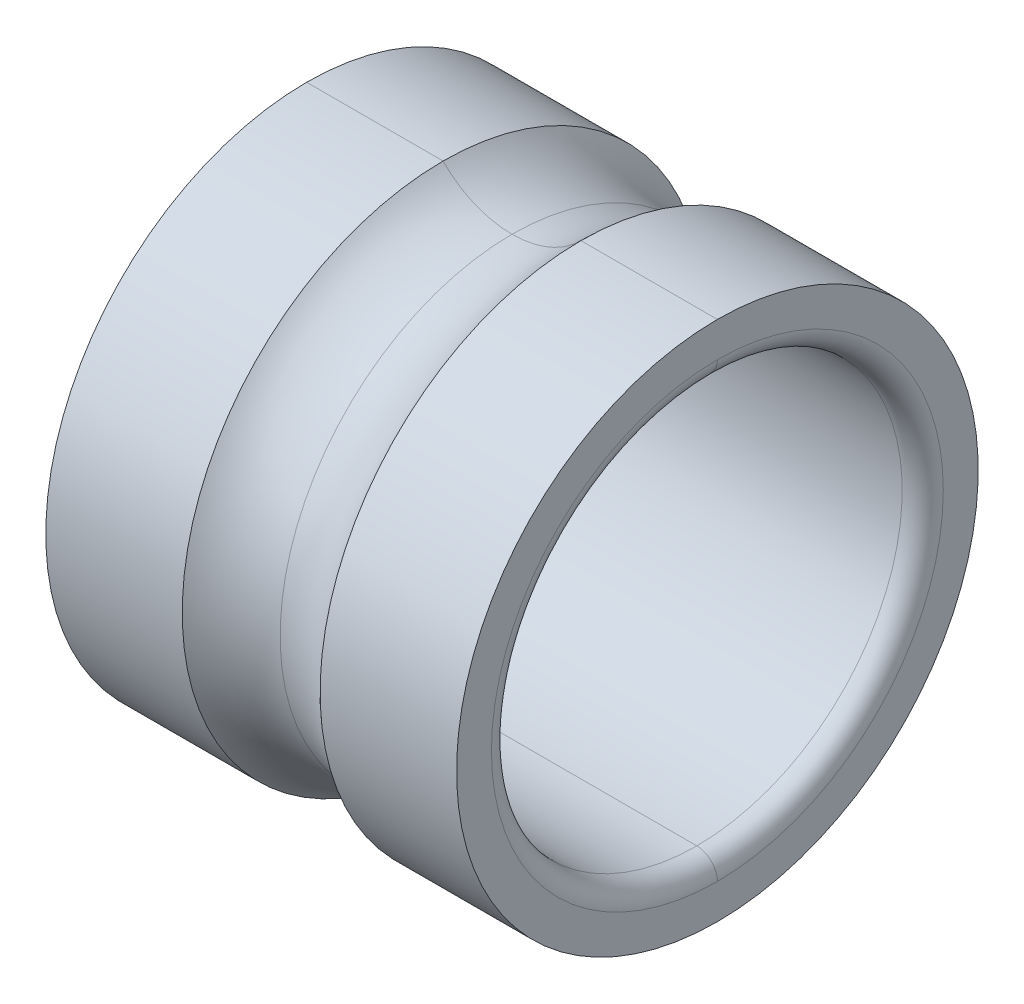
ISO-10303-21;
HEADER;
FILE_DESCRIPTION(('STEP AP214'),'2;1');
FILE_NAME('part.step','',(''),(''),'','','');
FILE_SCHEMA(('AUTOMOTIVE_DESIGN { 1 0 10303 214 1 1 1 1 }'));
ENDSEC;
DATA;
#1=APPLICATION_CONTEXT('core data for automotive mechanical design processes');
#2=APPLICATION_PROTOCOL_DEFINITION('international standard','automotive_design',2000,#1);
#3=PRODUCT_CONTEXT('',#1,'mechanical');
#4=PRODUCT('Part','Part','',(#3));
#5=PRODUCT_RELATED_PRODUCT_CATEGORY('part','',(#4));
#6=PRODUCT_DEFINITION_FORMATION('','',#4);
#7=PRODUCT_DEFINITION_CONTEXT('part definition',#1,'design');
#8=PRODUCT_DEFINITION('design','',#6,#7);
#9=PRODUCT_DEFINITION_SHAPE('','',#8);
#10=(LENGTH_UNIT() NAMED_UNIT(*) SI_UNIT(.MILLI.,.METRE.));
#11=(NAMED_UNIT(*) PLANE_ANGLE_UNIT() SI_UNIT($,.RADIAN.));
#12=(NAMED_UNIT(*) SI_UNIT($,.STERADIAN.) SOLID_ANGLE_UNIT());
#13=UNCERTAINTY_MEASURE_WITH_UNIT(LENGTH_MEASURE(1.E-05),#10,'distance_accuracy_value','');
#14=(GEOMETRIC_REPRESENTATION_CONTEXT(3) GLOBAL_UNCERTAINTY_ASSIGNED_CONTEXT((#13)) GLOBAL_UNIT_ASSIGNED_CONTEXT((#10,
#11,#12)) REPRESENTATION_CONTEXT('',''));
#15=CARTESIAN_POINT('',(0.,0.,0.));
#16=DIRECTION('',(0.,0.,1.));
#17=DIRECTION('',(1.,0.,0.));
#18=AXIS2_PLACEMENT_3D('',#15,#16,#17);
#19=CARTESIAN_POINT('',(-2.25171,0.,0.));
#20=DIRECTION('',(1.,0.,0.));
#21=DIRECTION('',(0.,-1.,0.));
#22=AXIS2_PLACEMENT_3D('',#19,#20,#21);
#23=TOROIDAL_SURFACE('',#22,2.75209,0.25019);
#24=CARTESIAN_POINT('',(-2.5019,0.,0.));
#25=DIRECTION('',(-1.,0.,0.));
#26=DIRECTION('',(0.,1.,0.));
#27=AXIS2_PLACEMENT_3D('',#24,#25,#26);
#28=CIRCLE('',#27,2.75209);
#29=CARTESIAN_POINT('',(-2.5019,2.75209,0.));
#30=VERTEX_POINT('',#29);
#31=CARTESIAN_POINT('',(-2.5019,-2.75209,0.));
#32=VERTEX_POINT('',#31);
#33=EDGE_CURVE('E168',#30,#32,#28,.T.);
#34=ORIENTED_EDGE('',*,*,#33,.T.);
#35=CARTESIAN_POINT('',(-2.25171,-2.75209,0.));
#36=DIRECTION('',(0.,0.,-1.));
#37=DIRECTION('',(-1.,0.,0.));
#38=AXIS2_PLACEMENT_3D('',#35,#36,#37);
#39=CIRCLE('',#38,0.25019);
#40=CARTESIAN_POINT('',(-2.25171,-2.5019,0.));
#41=VERTEX_POINT('',#40);
#42=EDGE_CURVE('E19',#32,#41,#39,.T.);
#43=ORIENTED_EDGE('',*,*,#42,.T.);
#44=CARTESIAN_POINT('',(-2.25171,0.,0.));
#45=DIRECTION('',(-1.,0.,0.));
#46=DIRECTION('',(0.,1.,0.));
#47=AXIS2_PLACEMENT_3D('',#44,#45,#46);
#48=CIRCLE('',#47,2.5019);
#49=CARTESIAN_POINT('',(-2.25171,2.5019,0.));
#50=VERTEX_POINT('',#49);
#51=EDGE_CURVE('E185',#50,#41,#48,.T.);
#52=ORIENTED_EDGE('',*,*,#51,.F.);
#53=CARTESIAN_POINT('',(-2.25171,2.75209,0.));
#54=DIRECTION('',(0.,0.,1.));
#55=DIRECTION('',(-1.,0.,0.));
#56=AXIS2_PLACEMENT_3D('',#53,#54,#55);
#57=CIRCLE('',#56,0.25019);
#58=EDGE_CURVE('E11',#30,#50,#57,.T.);
#59=ORIENTED_EDGE('',*,*,#58,.F.);
#60=EDGE_LOOP('',(#34,#43,#52,#59));
#61=FACE_BOUND('',#60,.T.);
#62=ADVANCED_FACE('F16',(#61),#23,.T.);
#63=CARTESIAN_POINT('',(-2.25171,0.,0.));
#64=DIRECTION('',(1.,0.,0.));
#65=DIRECTION('',(0.,-1.,0.));
#66=AXIS2_PLACEMENT_3D('',#63,#64,#65);
#67=TOROIDAL_SURFACE('',#66,2.75209,0.25019);
#68=CARTESIAN_POINT('',(-2.25171,0.,0.));
#69=DIRECTION('',(1.,0.,0.));
#70=DIRECTION('',(0.,1.,0.));
#71=AXIS2_PLACEMENT_3D('',#68,#69,#70);
#72=CIRCLE('',#71,2.5019);
#73=EDGE_CURVE('E129',#50,#41,#72,.T.);
#74=ORIENTED_EDGE('',*,*,#73,.T.);
#75=ORIENTED_EDGE('',*,*,#42,.F.);
#76=CARTESIAN_POINT('',(-2.5019,0.,0.));
#77=DIRECTION('',(1.,0.,0.));
#78=DIRECTION('',(0.,1.,0.));
#79=AXIS2_PLACEMENT_3D('',#76,#77,#78);
#80=CIRCLE('',#79,2.75209);
#81=EDGE_CURVE('E231',#30,#32,#80,.T.);
#82=ORIENTED_EDGE('',*,*,#81,.F.);
#83=ORIENTED_EDGE('',*,*,#58,.T.);
#84=EDGE_LOOP('',(#74,#75,#82,#83));
#85=FACE_BOUND('',#84,.T.);
#86=ADVANCED_FACE('F270',(#85),#67,.T.);
#87=CARTESIAN_POINT('',(-2.5019,0.,0.));
#88=DIRECTION('',(1.,0.,0.));
#89=DIRECTION('',(0.,1.,0.));
#90=AXIS2_PLACEMENT_3D('',#87,#88,#89);
#91=PLANE('',#90);
#92=ORIENTED_EDGE('',*,*,#33,.F.);
#93=ORIENTED_EDGE('',*,*,#81,.T.);
#94=EDGE_LOOP('',(#92,#93));
#95=FACE_BOUND('',#94,.T.);
#96=CARTESIAN_POINT('',(-2.5019,0.,0.));
#97=DIRECTION('',(1.,0.,0.));
#98=DIRECTION('',(0.,1.,0.));
#99=AXIS2_PLACEMENT_3D('',#96,#97,#98);
#100=CIRCLE('',#99,3.1773749);
#101=CARTESIAN_POINT('',(-2.5019,3.1773749,0.));
#102=VERTEX_POINT('',#101);
#103=CARTESIAN_POINT('',(-2.5019,-3.1773749,0.));
#104=VERTEX_POINT('',#103);
#105=EDGE_CURVE('E155',#102,#104,#100,.T.);
#106=ORIENTED_EDGE('',*,*,#105,.F.);
#107=CARTESIAN_POINT('',(-2.5019,0.,0.));
#108=DIRECTION('',(-1.,0.,0.));
#109=DIRECTION('',(0.,1.,0.));
#110=AXIS2_PLACEMENT_3D('',#107,#108,#109);
#111=CIRCLE('',#110,3.1773749);
#112=EDGE_CURVE('E140',#102,#104,#111,.T.);
#113=ORIENTED_EDGE('',*,*,#112,.T.);
#114=EDGE_LOOP('',(#106,#113));
#115=FACE_BOUND('',#114,.T.);
#116=ADVANCED_FACE('F275',(#95,#115),#91,.F.);
#117=CARTESIAN_POINT('',(-2.75209,0.,0.));
#118=DIRECTION('',(1.,0.,0.));
#119=DIRECTION('',(0.,-1.,0.));
#120=AXIS2_PLACEMENT_3D('',#117,#118,#119);
#121=CYLINDRICAL_SURFACE('',#120,3.1773749);
#122=CARTESIAN_POINT('',(-0.839755569912454,0.,0.));
#123=DIRECTION('',(-1.,0.,0.));
#124=DIRECTION('',(0.,1.,0.));
#125=AXIS2_PLACEMENT_3D('',#122,#123,#124);
#126=CIRCLE('',#125,3.1773749);
#127=CARTESIAN_POINT('',(-0.839755569912454,3.1773749,0.));
#128=VERTEX_POINT('',#127);
#129=CARTESIAN_POINT('',(-0.839755569912454,-3.1773749,0.));
#130=VERTEX_POINT('',#129);
#131=EDGE_CURVE('E146',#128,#130,#126,.T.);
#132=ORIENTED_EDGE('',*,*,#131,.T.);
#133=DIRECTION('',(-1.,0.,0.));
#134=VECTOR('',#133,1.);
#135=CARTESIAN_POINT('',(-0.839755569912453,-3.1773749,0.));
#136=LINE('',#135,#134);
#137=EDGE_CURVE('E159',#130,#104,#136,.T.);
#138=ORIENTED_EDGE('',*,*,#137,.T.);
#139=ORIENTED_EDGE('',*,*,#112,.F.);
#140=DIRECTION('',(-1.,0.,0.));
#141=VECTOR('',#140,1.);
#142=CARTESIAN_POINT('',(-0.839755569912453,3.1773749,0.));
#143=LINE('',#142,#141);
#144=EDGE_CURVE('E156',#128,#102,#143,.T.);
#145=ORIENTED_EDGE('',*,*,#144,.F.);
#146=EDGE_LOOP('',(#132,#138,#139,#145));
#147=FACE_BOUND('',#146,.T.);
#148=ADVANCED_FACE('F254',(#147),#121,.T.);
#149=CARTESIAN_POINT('',(-2.75209,0.,0.));
#150=DIRECTION('',(1.,0.,0.));
#151=DIRECTION('',(0.,-1.,0.));
#152=AXIS2_PLACEMENT_3D('',#149,#150,#151);
#153=CYLINDRICAL_SURFACE('',#152,3.1773749);
#154=ORIENTED_EDGE('',*,*,#105,.T.);
#155=ORIENTED_EDGE('',*,*,#137,.F.);
#156=CARTESIAN_POINT('',(-0.839755569912454,0.,0.));
#157=DIRECTION('',(1.,0.,0.));
#158=DIRECTION('',(0.,1.,0.));
#159=AXIS2_PLACEMENT_3D('',#156,#157,#158);
#160=CIRCLE('',#159,3.1773749);
#161=EDGE_CURVE('E152',#128,#130,#160,.T.);
#162=ORIENTED_EDGE('',*,*,#161,.F.);
#163=ORIENTED_EDGE('',*,*,#144,.T.);
#164=EDGE_LOOP('',(#154,#155,#162,#163));
#165=FACE_BOUND('',#164,.T.);
#166=ADVANCED_FACE('F267',(#165),#153,.T.);
#167=CARTESIAN_POINT('',(0.,0.,0.));
#168=DIRECTION('',(1.,0.,0.));
#169=DIRECTION('',(0.,-1.,0.));
#170=AXIS2_PLACEMENT_3D('',#167,#168,#169);
#171=TOROIDAL_SURFACE('',#170,4.0005,1.175893);
#172=CARTESIAN_POINT('',(0.,0.,0.));
#173=DIRECTION('',(1.,0.,0.));
#174=DIRECTION('',(0.,0.,-1.));
#175=AXIS2_PLACEMENT_3D('',#172,#173,#174);
#176=CIRCLE('',#175,2.824607);
#177=CARTESIAN_POINT('',(0.,2.824607,0.));
#178=VERTEX_POINT('',#177);
#179=CARTESIAN_POINT('',(0.,-2.824607,0.));
#180=VERTEX_POINT('',#179);
#181=EDGE_CURVE('E201',#178,#180,#176,.T.);
#182=ORIENTED_EDGE('',*,*,#181,.F.);
#183=CARTESIAN_POINT('',(0.,4.0005,0.));
#184=DIRECTION('',(0.,0.,-1.));
#185=DIRECTION('',(0.714142842854284,-0.7,0.));
#186=AXIS2_PLACEMENT_3D('',#183,#184,#185);
#187=CIRCLE('',#186,1.175893);
#188=EDGE_CURVE('E150',#178,#128,#187,.T.);
#189=ORIENTED_EDGE('',*,*,#188,.T.);
#190=ORIENTED_EDGE('',*,*,#161,.T.);
#191=CARTESIAN_POINT('',(0.,-4.0005,0.));
#192=DIRECTION('',(0.,0.,1.));
#193=DIRECTION('',(0.714142842854284,0.7,0.));
#194=AXIS2_PLACEMENT_3D('',#191,#192,#193);
#195=CIRCLE('',#194,1.175893);
#196=EDGE_CURVE('E151',#180,#130,#195,.T.);
#197=ORIENTED_EDGE('',*,*,#196,.F.);
#198=EDGE_LOOP('',(#182,#189,#190,#197));
#199=FACE_BOUND('',#198,.T.);
#200=ADVANCED_FACE('F253',(#199),#171,.F.);
#201=CARTESIAN_POINT('',(0.,0.,0.));
#202=DIRECTION('',(1.,0.,0.));
#203=DIRECTION('',(0.,-1.,0.));
#204=AXIS2_PLACEMENT_3D('',#201,#202,#203);
#205=TOROIDAL_SURFACE('',#204,4.0005,1.175893);
#206=CARTESIAN_POINT('',(0.,0.,0.));
#207=DIRECTION('',(1.,0.,0.));
#208=DIRECTION('',(0.,0.,-1.));
#209=AXIS2_PLACEMENT_3D('',#206,#207,#208);
#210=CIRCLE('',#209,2.824607);
#211=EDGE_CURVE('E207',#180,#178,#210,.T.);
#212=ORIENTED_EDGE('',*,*,#211,.F.);
#213=ORIENTED_EDGE('',*,*,#196,.T.);
#214=ORIENTED_EDGE('',*,*,#131,.F.);
#215=ORIENTED_EDGE('',*,*,#188,.F.);
#216=EDGE_LOOP('',(#212,#213,#214,#215));
#217=FACE_BOUND('',#216,.T.);
#218=ADVANCED_FACE('F255',(#217),#205,.F.);
#219=CARTESIAN_POINT('',(-2.75209,0.,0.));
#220=DIRECTION('',(1.,0.,0.));
#221=DIRECTION('',(0.,-1.,0.));
#222=AXIS2_PLACEMENT_3D('',#219,#220,#221);
#223=CYLINDRICAL_SURFACE('',#222,3.1773749);
#224=CARTESIAN_POINT('',(2.5019,0.,0.));
#225=DIRECTION('',(-1.,0.,0.));
#226=DIRECTION('',(0.,1.,0.));
#227=AXIS2_PLACEMENT_3D('',#224,#225,#226);
#228=CIRCLE('',#227,3.1773749);
#229=CARTESIAN_POINT('',(2.5019,3.1773749,0.));
#230=VERTEX_POINT('',#229);
#231=CARTESIAN_POINT('',(2.5019,-3.1773749,0.));
#232=VERTEX_POINT('',#231);
#233=EDGE_CURVE('E116',#230,#232,#228,.T.);
#234=ORIENTED_EDGE('',*,*,#233,.T.);
#235=DIRECTION('',(-1.,0.,0.));
#236=VECTOR('',#235,1.);
#237=CARTESIAN_POINT('',(2.5019,-3.1773749,0.));
#238=LINE('',#237,#236);
#239=CARTESIAN_POINT('',(0.839755569912453,-3.1773749,0.));
#240=VERTEX_POINT('',#239);
#241=EDGE_CURVE('E192',#232,#240,#238,.T.);
#242=ORIENTED_EDGE('',*,*,#241,.T.);
#243=CARTESIAN_POINT('',(0.839755569912454,0.,0.));
#244=DIRECTION('',(-1.,0.,0.));
#245=DIRECTION('',(0.,1.,0.));
#246=AXIS2_PLACEMENT_3D('',#243,#244,#245);
#247=CIRCLE('',#246,3.1773749);
#248=CARTESIAN_POINT('',(0.839755569912453,3.1773749,0.));
#249=VERTEX_POINT('',#248);
#250=EDGE_CURVE('E195',#249,#240,#247,.T.);
#251=ORIENTED_EDGE('',*,*,#250,.F.);
#252=DIRECTION('',(-1.,0.,0.));
#253=VECTOR('',#252,1.);
#254=CARTESIAN_POINT('',(2.5019,3.1773749,0.));
#255=LINE('',#254,#253);
#256=EDGE_CURVE('E200',#230,#249,#255,.T.);
#257=ORIENTED_EDGE('',*,*,#256,.F.);
#258=EDGE_LOOP('',(#234,#242,#251,#257));
#259=FACE_BOUND('',#258,.T.);
#260=ADVANCED_FACE('F257',(#259),#223,.T.);
#261=CARTESIAN_POINT('',(-2.75209,0.,0.));
#262=DIRECTION('',(1.,0.,0.));
#263=DIRECTION('',(0.,-1.,0.));
#264=AXIS2_PLACEMENT_3D('',#261,#262,#263);
#265=CYLINDRICAL_SURFACE('',#264,3.1773749);
#266=CARTESIAN_POINT('',(0.839755569912454,0.,0.));
#267=DIRECTION('',(1.,0.,0.));
#268=DIRECTION('',(0.,1.,0.));
#269=AXIS2_PLACEMENT_3D('',#266,#267,#268);
#270=CIRCLE('',#269,3.1773749);
#271=EDGE_CURVE('E178',#249,#240,#270,.T.);
#272=ORIENTED_EDGE('',*,*,#271,.T.);
#273=ORIENTED_EDGE('',*,*,#241,.F.);
#274=CARTESIAN_POINT('',(2.5019,0.,0.));
#275=DIRECTION('',(1.,0.,0.));
#276=DIRECTION('',(0.,1.,0.));
#277=AXIS2_PLACEMENT_3D('',#274,#275,#276);
#278=CIRCLE('',#277,3.1773749);
#279=EDGE_CURVE('E145',#230,#232,#278,.T.);
#280=ORIENTED_EDGE('',*,*,#279,.F.);
#281=ORIENTED_EDGE('',*,*,#256,.T.);
#282=EDGE_LOOP('',(#272,#273,#280,#281));
#283=FACE_BOUND('',#282,.T.);
#284=ADVANCED_FACE('F264',(#283),#265,.T.);
#285=CARTESIAN_POINT('',(2.5019,0.,0.));
#286=DIRECTION('',(1.,0.,0.));
#287=DIRECTION('',(0.,1.,0.));
#288=AXIS2_PLACEMENT_3D('',#285,#286,#287);
#289=PLANE('',#288);
#290=CARTESIAN_POINT('',(2.5019,0.,0.));
#291=DIRECTION('',(1.,0.,0.));
#292=DIRECTION('',(0.,1.,0.));
#293=AXIS2_PLACEMENT_3D('',#290,#291,#292);
#294=CIRCLE('',#293,2.75209);
#295=CARTESIAN_POINT('',(2.5019,2.75209,0.));
#296=VERTEX_POINT('',#295);
#297=CARTESIAN_POINT('',(2.5019,-2.75209,0.));
#298=VERTEX_POINT('',#297);
#299=EDGE_CURVE('E120',#296,#298,#294,.T.);
#300=ORIENTED_EDGE('',*,*,#299,.F.);
#301=CARTESIAN_POINT('',(2.5019,0.,0.));
#302=DIRECTION('',(-1.,0.,0.));
#303=DIRECTION('',(0.,1.,0.));
#304=AXIS2_PLACEMENT_3D('',#301,#302,#303);
#305=CIRCLE('',#304,2.75209);
#306=EDGE_CURVE('E102',#296,#298,#305,.T.);
#307=ORIENTED_EDGE('',*,*,#306,.T.);
#308=EDGE_LOOP('',(#300,#307));
#309=FACE_BOUND('',#308,.T.);
#310=ORIENTED_EDGE('',*,*,#233,.F.);
#311=ORIENTED_EDGE('',*,*,#279,.T.);
#312=EDGE_LOOP('',(#310,#311));
#313=FACE_BOUND('',#312,.T.);
#314=ADVANCED_FACE('F126',(#309,#313),#289,.T.);
#315=CARTESIAN_POINT('',(2.25171,0.,0.));
#316=DIRECTION('',(1.,0.,0.));
#317=DIRECTION('',(0.,-1.,0.));
#318=AXIS2_PLACEMENT_3D('',#315,#316,#317);
#319=TOROIDAL_SURFACE('',#318,2.75209,0.25019);
#320=CARTESIAN_POINT('',(2.25171,0.,0.));
#321=DIRECTION('',(-1.,0.,0.));
#322=DIRECTION('',(0.,1.,0.));
#323=AXIS2_PLACEMENT_3D('',#320,#321,#322);
#324=CIRCLE('',#323,2.5019);
#325=CARTESIAN_POINT('',(2.25171,2.5019,0.));
#326=VERTEX_POINT('',#325);
#327=CARTESIAN_POINT('',(2.25171,-2.5019,0.));
#328=VERTEX_POINT('',#327);
#329=EDGE_CURVE('E184',#326,#328,#324,.T.);
#330=ORIENTED_EDGE('',*,*,#329,.T.);
#331=CARTESIAN_POINT('',(2.25171,-2.75209,0.));
#332=DIRECTION('',(0.,0.,-1.));
#333=DIRECTION('',(0.,1.,0.));
#334=AXIS2_PLACEMENT_3D('',#331,#332,#333);
#335=CIRCLE('',#334,0.25019);
#336=EDGE_CURVE('E113',#328,#298,#335,.T.);
#337=ORIENTED_EDGE('',*,*,#336,.T.);
#338=ORIENTED_EDGE('',*,*,#306,.F.);
#339=CARTESIAN_POINT('',(2.25171,2.75209,0.));
#340=DIRECTION('',(0.,0.,1.));
#341=DIRECTION('',(0.,-1.,0.));
#342=AXIS2_PLACEMENT_3D('',#339,#340,#341);
#343=CIRCLE('',#342,0.25019);
#344=EDGE_CURVE('E111',#326,#296,#343,.T.);
#345=ORIENTED_EDGE('',*,*,#344,.F.);
#346=EDGE_LOOP('',(#330,#337,#338,#345));
#347=FACE_BOUND('',#346,.T.);
#348=ADVANCED_FACE('F110',(#347),#319,.T.);
#349=CARTESIAN_POINT('',(2.25171,0.,0.));
#350=DIRECTION('',(1.,0.,0.));
#351=DIRECTION('',(0.,-1.,0.));
#352=AXIS2_PLACEMENT_3D('',#349,#350,#351);
#353=TOROIDAL_SURFACE('',#352,2.75209,0.25019);
#354=ORIENTED_EDGE('',*,*,#299,.T.);
#355=ORIENTED_EDGE('',*,*,#336,.F.);
#356=CARTESIAN_POINT('',(2.25171,0.,0.));
#357=DIRECTION('',(1.,0.,0.));
#358=DIRECTION('',(0.,1.,0.));
#359=AXIS2_PLACEMENT_3D('',#356,#357,#358);
#360=CIRCLE('',#359,2.5019);
#361=EDGE_CURVE('E122',#326,#328,#360,.T.);
#362=ORIENTED_EDGE('',*,*,#361,.F.);
#363=ORIENTED_EDGE('',*,*,#344,.T.);
#364=EDGE_LOOP('',(#354,#355,#362,#363));
#365=FACE_BOUND('',#364,.T.);
#366=ADVANCED_FACE('F119',(#365),#353,.T.);
#367=CARTESIAN_POINT('',(-2.75209,0.,0.));
#368=DIRECTION('',(1.,0.,0.));
#369=DIRECTION('',(0.,-1.,0.));
#370=AXIS2_PLACEMENT_3D('',#367,#368,#369);
#371=CYLINDRICAL_SURFACE('',#370,2.5019);
#372=ORIENTED_EDGE('',*,*,#361,.T.);
#373=DIRECTION('',(1.,0.,0.));
#374=VECTOR('',#373,1.);
#375=CARTESIAN_POINT('',(-2.25171,-2.5019,0.));
#376=LINE('',#375,#374);
#377=EDGE_CURVE('E180',#41,#328,#376,.T.);
#378=ORIENTED_EDGE('',*,*,#377,.F.);
#379=ORIENTED_EDGE('',*,*,#73,.F.);
#380=DIRECTION('',(1.,0.,0.));
#381=VECTOR('',#380,1.);
#382=CARTESIAN_POINT('',(-2.25171,2.5019,0.));
#383=LINE('',#382,#381);
#384=EDGE_CURVE('E235',#50,#326,#383,.T.);
#385=ORIENTED_EDGE('',*,*,#384,.T.);
#386=EDGE_LOOP('',(#372,#378,#379,#385));
#387=FACE_BOUND('',#386,.T.);
#388=ADVANCED_FACE('F290',(#387),#371,.F.);
#389=CARTESIAN_POINT('',(-2.75209,0.,0.));
#390=DIRECTION('',(1.,0.,0.));
#391=DIRECTION('',(0.,-1.,0.));
#392=AXIS2_PLACEMENT_3D('',#389,#390,#391);
#393=CYLINDRICAL_SURFACE('',#392,2.5019);
#394=ORIENTED_EDGE('',*,*,#51,.T.);
#395=ORIENTED_EDGE('',*,*,#377,.T.);
#396=ORIENTED_EDGE('',*,*,#329,.F.);
#397=ORIENTED_EDGE('',*,*,#384,.F.);
#398=EDGE_LOOP('',(#394,#395,#396,#397));
#399=FACE_BOUND('',#398,.T.);
#400=ADVANCED_FACE('F296',(#399),#393,.F.);
#401=CARTESIAN_POINT('',(0.,0.,0.));
#402=DIRECTION('',(1.,0.,0.));
#403=DIRECTION('',(0.,-1.,0.));
#404=AXIS2_PLACEMENT_3D('',#401,#402,#403);
#405=TOROIDAL_SURFACE('',#404,4.0005,1.175893);
#406=CARTESIAN_POINT('',(0.,-4.0005,0.));
#407=DIRECTION('',(0.,0.,1.));
#408=DIRECTION('',(0.714142842854284,0.7,0.));
#409=AXIS2_PLACEMENT_3D('',#406,#407,#408);
#410=CIRCLE('',#409,1.175893);
#411=EDGE_CURVE('E205',#240,#180,#410,.T.);
#412=ORIENTED_EDGE('',*,*,#411,.T.);
#413=ORIENTED_EDGE('',*,*,#211,.T.);
#414=CARTESIAN_POINT('',(0.,4.0005,0.));
#415=DIRECTION('',(0.,0.,-1.));
#416=DIRECTION('',(0.714142842854284,-0.7,0.));
#417=AXIS2_PLACEMENT_3D('',#414,#415,#416);
#418=CIRCLE('',#417,1.175893);
#419=EDGE_CURVE('E206',#249,#178,#418,.T.);
#420=ORIENTED_EDGE('',*,*,#419,.F.);
#421=ORIENTED_EDGE('',*,*,#250,.T.);
#422=EDGE_LOOP('',(#412,#413,#420,#421));
#423=FACE_BOUND('',#422,.T.);
#424=ADVANCED_FACE('F251',(#423),#405,.F.);
#425=CARTESIAN_POINT('',(0.,0.,0.));
#426=DIRECTION('',(1.,0.,0.));
#427=DIRECTION('',(0.,-1.,0.));
#428=AXIS2_PLACEMENT_3D('',#425,#426,#427);
#429=TOROIDAL_SURFACE('',#428,4.0005,1.175893);
#430=ORIENTED_EDGE('',*,*,#419,.T.);
#431=ORIENTED_EDGE('',*,*,#181,.T.);
#432=ORIENTED_EDGE('',*,*,#411,.F.);
#433=ORIENTED_EDGE('',*,*,#271,.F.);
#434=EDGE_LOOP('',(#430,#431,#432,#433));
#435=FACE_BOUND('',#434,.T.);
#436=ADVANCED_FACE('F247',(#435),#429,.F.);
#437=CLOSED_SHELL('',(#62,#86,#116,#148,#166,#200,#218,#260,#284,#314,#348,#366,#388,#400,#424,#436));
#438=MANIFOLD_SOLID_BREP('B1',#437);
#439=ADVANCED_BREP_SHAPE_REPRESENTATION('',(#18,#438),#14);
#440=SHAPE_DEFINITION_REPRESENTATION(#9,#439);
ENDSEC;
END-ISO-10303-21;
